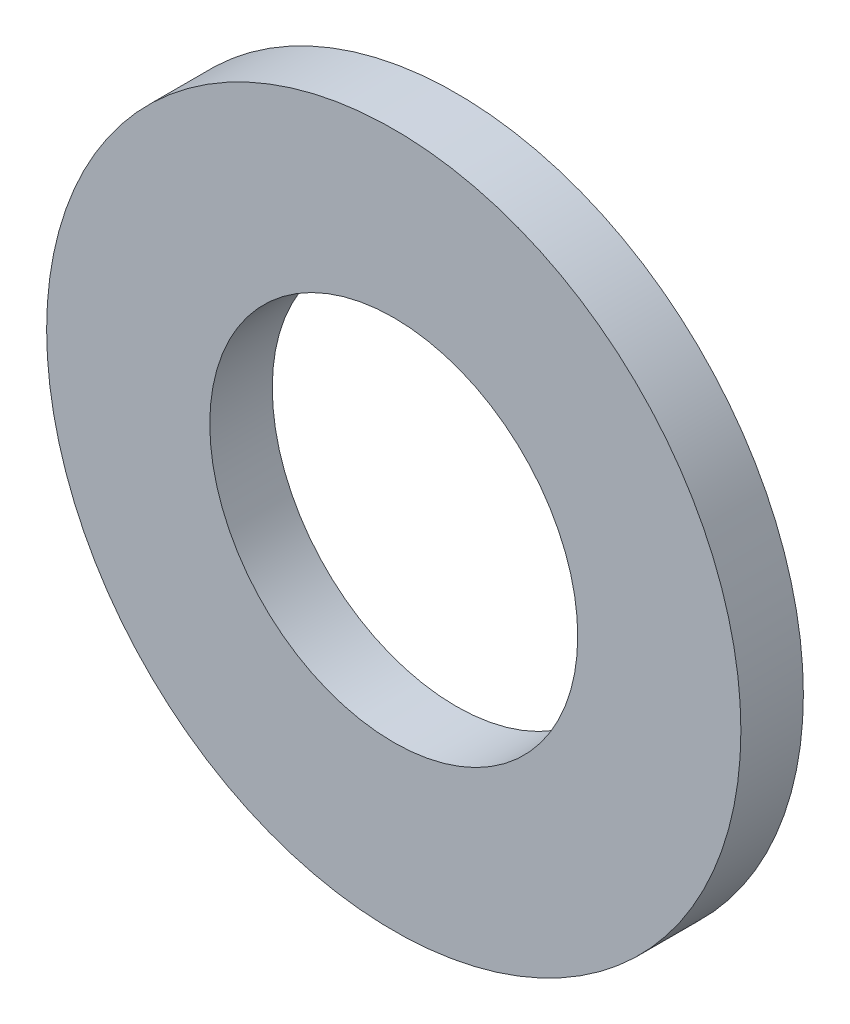
ISO-10303-21;
HEADER;
FILE_DESCRIPTION(('STEP AP214'),'2;1');
FILE_NAME('part.step','',(''),(''),'','','');
FILE_SCHEMA(('AUTOMOTIVE_DESIGN { 1 0 10303 214 1 1 1 1 }'));
ENDSEC;
DATA;
#1=APPLICATION_CONTEXT('core data for automotive mechanical design processes');
#2=APPLICATION_PROTOCOL_DEFINITION('international standard','automotive_design',2000,#1);
#3=PRODUCT_CONTEXT('',#1,'mechanical');
#4=PRODUCT('Part','Part','',(#3));
#5=PRODUCT_RELATED_PRODUCT_CATEGORY('part','',(#4));
#6=PRODUCT_DEFINITION_FORMATION('','',#4);
#7=PRODUCT_DEFINITION_CONTEXT('part definition',#1,'design');
#8=PRODUCT_DEFINITION('design','',#6,#7);
#9=PRODUCT_DEFINITION_SHAPE('','',#8);
#10=(LENGTH_UNIT() NAMED_UNIT(*) SI_UNIT(.MILLI.,.METRE.));
#11=(NAMED_UNIT(*) PLANE_ANGLE_UNIT() SI_UNIT($,.RADIAN.));
#12=(NAMED_UNIT(*) SI_UNIT($,.STERADIAN.) SOLID_ANGLE_UNIT());
#13=UNCERTAINTY_MEASURE_WITH_UNIT(LENGTH_MEASURE(1.E-05),#10,'distance_accuracy_value','');
#14=(GEOMETRIC_REPRESENTATION_CONTEXT(3) GLOBAL_UNCERTAINTY_ASSIGNED_CONTEXT((#13)) GLOBAL_UNIT_ASSIGNED_CONTEXT((#10,
#11,#12)) REPRESENTATION_CONTEXT('',''));
#15=CARTESIAN_POINT('',(0.,0.,0.));
#16=DIRECTION('',(0.,0.,1.));
#17=DIRECTION('',(1.,0.,0.));
#18=AXIS2_PLACEMENT_3D('',#15,#16,#17);
#19=CARTESIAN_POINT('',(0.,0.,0.));
#20=DIRECTION('',(0.,0.,1.));
#21=DIRECTION('',(1.,0.,0.));
#22=AXIS2_PLACEMENT_3D('',#19,#20,#21);
#23=PLANE('',#22);
#24=CARTESIAN_POINT('',(0.,0.,0.));
#25=DIRECTION('',(0.,0.,1.));
#26=DIRECTION('',(1.,0.,0.));
#27=AXIS2_PLACEMENT_3D('',#24,#25,#26);
#28=CIRCLE('',#27,2.65);
#29=CARTESIAN_POINT('',(2.65,0.,0.));
#30=VERTEX_POINT('',#29);
#31=EDGE_CURVE('E26',#30,#30,#28,.F.);
#32=ORIENTED_EDGE('',*,*,#31,.T.);
#33=EDGE_LOOP('',(#32));
#34=FACE_BOUND('',#33,.T.);
#35=CARTESIAN_POINT('',(0.,0.,0.));
#36=DIRECTION('',(0.,0.,1.));
#37=DIRECTION('',(1.,0.,0.));
#38=AXIS2_PLACEMENT_3D('',#35,#36,#37);
#39=CIRCLE('',#38,5.);
#40=CARTESIAN_POINT('',(5.,0.,0.));
#41=VERTEX_POINT('',#40);
#42=EDGE_CURVE('E17',#41,#41,#39,.F.);
#43=ORIENTED_EDGE('',*,*,#42,.F.);
#44=EDGE_LOOP('',(#43));
#45=FACE_BOUND('',#44,.T.);
#46=ADVANCED_FACE('F14',(#34,#45),#23,.T.);
#47=CARTESIAN_POINT('',(0.,0.,-0.9));
#48=DIRECTION('',(0.,0.,1.));
#49=DIRECTION('',(1.,0.,0.));
#50=AXIS2_PLACEMENT_3D('',#47,#48,#49);
#51=CYLINDRICAL_SURFACE('',#50,5.);
#52=ORIENTED_EDGE('',*,*,#42,.T.);
#53=EDGE_LOOP('',(#52));
#54=FACE_BOUND('',#53,.T.);
#55=CARTESIAN_POINT('',(0.,0.,-0.9));
#56=DIRECTION('',(0.,0.,1.));
#57=DIRECTION('',(1.,0.,0.));
#58=AXIS2_PLACEMENT_3D('',#55,#56,#57);
#59=CIRCLE('',#58,5.);
#60=CARTESIAN_POINT('',(5.,0.,-0.9));
#61=VERTEX_POINT('',#60);
#62=EDGE_CURVE('E21',#61,#61,#59,.T.);
#63=ORIENTED_EDGE('',*,*,#62,.T.);
#64=EDGE_LOOP('',(#63));
#65=FACE_BOUND('',#64,.T.);
#66=ADVANCED_FACE('F34',(#54,#65),#51,.T.);
#67=CARTESIAN_POINT('',(0.,0.,-0.9));
#68=DIRECTION('',(0.,0.,1.));
#69=DIRECTION('',(1.,0.,0.));
#70=AXIS2_PLACEMENT_3D('',#67,#68,#69);
#71=CYLINDRICAL_SURFACE('',#70,2.65);
#72=ORIENTED_EDGE('',*,*,#31,.F.);
#73=EDGE_LOOP('',(#72));
#74=FACE_BOUND('',#73,.T.);
#75=CARTESIAN_POINT('',(0.,0.,-0.9));
#76=DIRECTION('',(0.,0.,1.));
#77=DIRECTION('',(1.,0.,0.));
#78=AXIS2_PLACEMENT_3D('',#75,#76,#77);
#79=CIRCLE('',#78,2.65);
#80=CARTESIAN_POINT('',(2.65,0.,-0.9));
#81=VERTEX_POINT('',#80);
#82=EDGE_CURVE('E10',#81,#81,#79,.F.);
#83=ORIENTED_EDGE('',*,*,#82,.T.);
#84=EDGE_LOOP('',(#83));
#85=FACE_BOUND('',#84,.T.);
#86=ADVANCED_FACE('F42',(#74,#85),#71,.F.);
#87=CARTESIAN_POINT('',(0.,0.,-0.9));
#88=DIRECTION('',(0.,0.,1.));
#89=DIRECTION('',(1.,0.,0.));
#90=AXIS2_PLACEMENT_3D('',#87,#88,#89);
#91=PLANE('',#90);
#92=ORIENTED_EDGE('',*,*,#82,.F.);
#93=EDGE_LOOP('',(#92));
#94=FACE_BOUND('',#93,.T.);
#95=ORIENTED_EDGE('',*,*,#62,.F.);
#96=EDGE_LOOP('',(#95));
#97=FACE_BOUND('',#96,.T.);
#98=ADVANCED_FACE('F43',(#94,#97),#91,.F.);
#99=CLOSED_SHELL('',(#46,#66,#86,#98));
#100=MANIFOLD_SOLID_BREP('B1',#99);
#101=ADVANCED_BREP_SHAPE_REPRESENTATION('',(#18,#100),#14);
#102=SHAPE_DEFINITION_REPRESENTATION(#9,#101);
ENDSEC;
END-ISO-10303-21;
